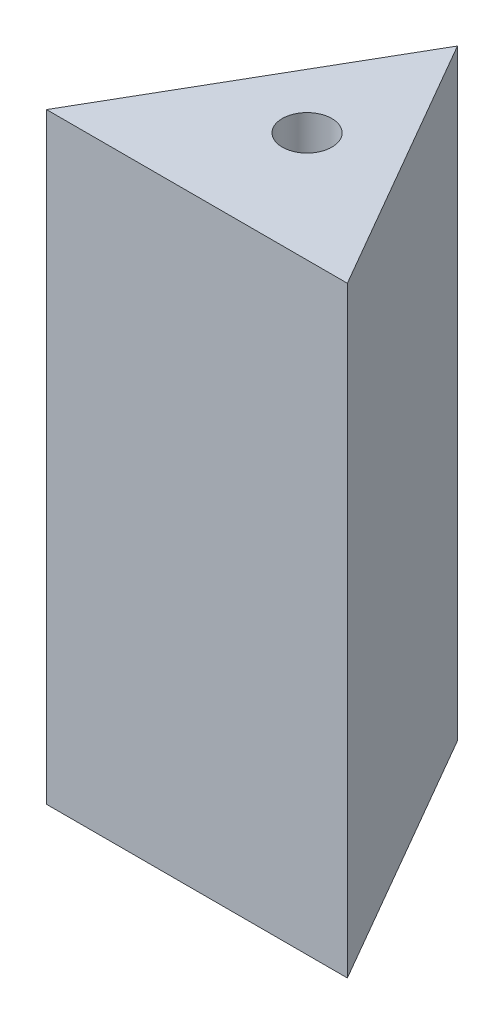
ISO-10303-21;
HEADER;
FILE_DESCRIPTION(('STEP AP214'),'2;1');
FILE_NAME('part.step','',(''),(''),'','','');
FILE_SCHEMA(('AUTOMOTIVE_DESIGN { 1 0 10303 214 1 1 1 1 }'));
ENDSEC;
DATA;
#1=APPLICATION_CONTEXT('core data for automotive mechanical design processes');
#2=APPLICATION_PROTOCOL_DEFINITION('international standard','automotive_design',2000,#1);
#3=PRODUCT_CONTEXT('',#1,'mechanical');
#4=PRODUCT('Part','Part','',(#3));
#5=PRODUCT_RELATED_PRODUCT_CATEGORY('part','',(#4));
#6=PRODUCT_DEFINITION_FORMATION('','',#4);
#7=PRODUCT_DEFINITION_CONTEXT('part definition',#1,'design');
#8=PRODUCT_DEFINITION('design','',#6,#7);
#9=PRODUCT_DEFINITION_SHAPE('','',#8);
#10=(LENGTH_UNIT() NAMED_UNIT(*) SI_UNIT(.MILLI.,.METRE.));
#11=(NAMED_UNIT(*) PLANE_ANGLE_UNIT() SI_UNIT($,.RADIAN.));
#12=(NAMED_UNIT(*) SI_UNIT($,.STERADIAN.) SOLID_ANGLE_UNIT());
#13=UNCERTAINTY_MEASURE_WITH_UNIT(LENGTH_MEASURE(1.E-05),#10,'distance_accuracy_value','');
#14=(GEOMETRIC_REPRESENTATION_CONTEXT(3) GLOBAL_UNCERTAINTY_ASSIGNED_CONTEXT((#13)) GLOBAL_UNIT_ASSIGNED_CONTEXT((#10,
#11,#12)) REPRESENTATION_CONTEXT('',''));
#15=CARTESIAN_POINT('',(0.,0.,0.));
#16=DIRECTION('',(0.,0.,1.));
#17=DIRECTION('',(1.,0.,0.));
#18=AXIS2_PLACEMENT_3D('',#15,#16,#17);
#19=CARTESIAN_POINT('',(0.,40.,0.));
#20=DIRECTION('',(-0.86602540378444,0.,-0.499999999999998));
#21=DIRECTION('',(-0.499999999999998,0.,0.86602540378444));
#22=AXIS2_PLACEMENT_3D('',#19,#20,#21);
#23=PLANE('',#22);
#24=DIRECTION('',(0.499999999999998,0.,-0.86602540378444));
#25=VECTOR('',#24,1.);
#26=CARTESIAN_POINT('',(0.,0.,0.));
#27=LINE('',#26,#25);
#28=CARTESIAN_POINT('',(0.,0.,0.));
#29=VERTEX_POINT('',#28);
#30=CARTESIAN_POINT('',(9.99999999999995,0.,-17.3205080756888));
#31=VERTEX_POINT('',#30);
#32=EDGE_CURVE('E111',#29,#31,#27,.T.);
#33=ORIENTED_EDGE('',*,*,#32,.F.);
#34=DIRECTION('',(0.,-1.,0.));
#35=VECTOR('',#34,1.);
#36=CARTESIAN_POINT('',(0.,40.,0.));
#37=LINE('',#36,#35);
#38=CARTESIAN_POINT('',(0.,40.,0.));
#39=VERTEX_POINT('',#38);
#40=EDGE_CURVE('E11',#39,#29,#37,.T.);
#41=ORIENTED_EDGE('',*,*,#40,.F.);
#42=DIRECTION('',(0.499999999999998,0.,-0.86602540378444));
#43=VECTOR('',#42,1.);
#44=CARTESIAN_POINT('',(0.,40.,0.));
#45=LINE('',#44,#43);
#46=CARTESIAN_POINT('',(9.99999999999995,40.,-17.3205080756888));
#47=VERTEX_POINT('',#46);
#48=EDGE_CURVE('E112',#39,#47,#45,.T.);
#49=ORIENTED_EDGE('',*,*,#48,.T.);
#50=DIRECTION('',(0.,-1.,0.));
#51=VECTOR('',#50,1.);
#52=CARTESIAN_POINT('',(9.99999999999995,40.,-17.3205080756888));
#53=LINE('',#52,#51);
#54=EDGE_CURVE('E62',#47,#31,#53,.T.);
#55=ORIENTED_EDGE('',*,*,#54,.T.);
#56=EDGE_LOOP('',(#33,#41,#49,#55));
#57=FACE_BOUND('',#56,.T.);
#58=ADVANCED_FACE('F45',(#57),#23,.T.);
#59=CARTESIAN_POINT('',(0.,40.,0.));
#60=DIRECTION('',(0.,0.,-1.));
#61=DIRECTION('',(-1.,0.,0.));
#62=AXIS2_PLACEMENT_3D('',#59,#60,#61);
#63=PLANE('',#62);
#64=DIRECTION('',(1.,0.,0.));
#65=VECTOR('',#64,1.);
#66=CARTESIAN_POINT('',(0.,0.,0.));
#67=LINE('',#66,#65);
#68=CARTESIAN_POINT('',(20.,0.,0.));
#69=VERTEX_POINT('',#68);
#70=EDGE_CURVE('E124',#29,#69,#67,.T.);
#71=ORIENTED_EDGE('',*,*,#70,.T.);
#72=DIRECTION('',(0.,-1.,0.));
#73=VECTOR('',#72,1.);
#74=CARTESIAN_POINT('',(20.,40.,0.));
#75=LINE('',#74,#73);
#76=CARTESIAN_POINT('',(20.,40.,0.));
#77=VERTEX_POINT('',#76);
#78=EDGE_CURVE('E54',#77,#69,#75,.T.);
#79=ORIENTED_EDGE('',*,*,#78,.F.);
#80=DIRECTION('',(1.,0.,0.));
#81=VECTOR('',#80,1.);
#82=CARTESIAN_POINT('',(0.,40.,0.));
#83=LINE('',#82,#81);
#84=EDGE_CURVE('E115',#39,#77,#83,.T.);
#85=ORIENTED_EDGE('',*,*,#84,.F.);
#86=ORIENTED_EDGE('',*,*,#40,.T.);
#87=EDGE_LOOP('',(#71,#79,#85,#86));
#88=FACE_BOUND('',#87,.T.);
#89=ADVANCED_FACE('F138',(#88),#63,.F.);
#90=CARTESIAN_POINT('',(15.,40.,-8.6602540378444));
#91=DIRECTION('',(0.866025403784438,0.,-0.500000000000001));
#92=DIRECTION('',(-0.500000000000001,0.,-0.866025403784438));
#93=AXIS2_PLACEMENT_3D('',#90,#91,#92);
#94=PLANE('',#93);
#95=DIRECTION('',(0.500000000000001,0.,0.866025403784438));
#96=VECTOR('',#95,1.);
#97=CARTESIAN_POINT('',(15.,0.,-8.6602540378444));
#98=LINE('',#97,#96);
#99=EDGE_CURVE('E116',#31,#69,#98,.T.);
#100=ORIENTED_EDGE('',*,*,#99,.F.);
#101=ORIENTED_EDGE('',*,*,#54,.F.);
#102=DIRECTION('',(0.500000000000001,0.,0.866025403784438));
#103=VECTOR('',#102,1.);
#104=CARTESIAN_POINT('',(15.,40.,-8.6602540378444));
#105=LINE('',#104,#103);
#106=EDGE_CURVE('E119',#47,#77,#105,.T.);
#107=ORIENTED_EDGE('',*,*,#106,.T.);
#108=ORIENTED_EDGE('',*,*,#78,.T.);
#109=EDGE_LOOP('',(#100,#101,#107,#108));
#110=FACE_BOUND('',#109,.T.);
#111=ADVANCED_FACE('F135',(#110),#94,.T.);
#112=CARTESIAN_POINT('',(0.,40.,0.));
#113=DIRECTION('',(0.,1.,0.));
#114=DIRECTION('',(0.,0.,1.));
#115=AXIS2_PLACEMENT_3D('',#112,#113,#114);
#116=PLANE('',#115);
#117=CARTESIAN_POINT('',(9.99999999999995,40.,-7.3205080756888));
#118=DIRECTION('',(0.,1.,0.));
#119=DIRECTION('',(0.,0.,1.));
#120=AXIS2_PLACEMENT_3D('',#117,#118,#119);
#121=CIRCLE('',#120,1.64999999999999);
#122=CARTESIAN_POINT('',(9.99999999999995,40.,-5.67050807568881));
#123=VERTEX_POINT('',#122);
#124=EDGE_CURVE('E98',#123,#123,#121,.T.);
#125=ORIENTED_EDGE('',*,*,#124,.F.);
#126=EDGE_LOOP('',(#125));
#127=FACE_BOUND('',#126,.T.);
#128=ORIENTED_EDGE('',*,*,#48,.F.);
#129=ORIENTED_EDGE('',*,*,#84,.T.);
#130=ORIENTED_EDGE('',*,*,#106,.F.);
#131=EDGE_LOOP('',(#128,#129,#130));
#132=FACE_BOUND('',#131,.T.);
#133=ADVANCED_FACE('F137',(#127,#132),#116,.T.);
#134=CARTESIAN_POINT('',(0.,0.,0.));
#135=DIRECTION('',(0.,1.,0.));
#136=DIRECTION('',(0.,0.,1.));
#137=AXIS2_PLACEMENT_3D('',#134,#135,#136);
#138=PLANE('',#137);
#139=CARTESIAN_POINT('',(9.99999999999995,0.,-7.3205080756888));
#140=DIRECTION('',(0.,-1.,0.));
#141=DIRECTION('',(0.,0.,-1.));
#142=AXIS2_PLACEMENT_3D('',#139,#140,#141);
#143=CIRCLE('',#142,1.64999999999999);
#144=CARTESIAN_POINT('',(9.99999999999995,0.,-8.97050807568879));
#145=VERTEX_POINT('',#144);
#146=EDGE_CURVE('E97',#145,#145,#143,.T.);
#147=ORIENTED_EDGE('',*,*,#146,.F.);
#148=EDGE_LOOP('',(#147));
#149=FACE_BOUND('',#148,.T.);
#150=ORIENTED_EDGE('',*,*,#32,.T.);
#151=ORIENTED_EDGE('',*,*,#99,.T.);
#152=ORIENTED_EDGE('',*,*,#70,.F.);
#153=EDGE_LOOP('',(#150,#151,#152));
#154=FACE_BOUND('',#153,.T.);
#155=ADVANCED_FACE('F134',(#149,#154),#138,.F.);
#156=CARTESIAN_POINT('',(9.99999999999995,10.1,-7.3205080756888));
#157=DIRECTION('',(0.,-1.,0.));
#158=DIRECTION('',(0.,0.,-1.));
#159=AXIS2_PLACEMENT_3D('',#156,#157,#158);
#160=CONICAL_SURFACE('',#159,1.64999999999999,1.02974425867665);
#161=CARTESIAN_POINT('',(9.99999999999995,11.0914200213955,-7.3205080756888));
#162=VERTEX_POINT('',#161);
#163=VERTEX_LOOP('',#162);
#164=FACE_BOUND('',#163,.T.);
#165=CARTESIAN_POINT('',(9.99999999999995,10.1,-7.3205080756888));
#166=DIRECTION('',(0.,-1.,0.));
#167=DIRECTION('',(0.,0.,-1.));
#168=AXIS2_PLACEMENT_3D('',#165,#166,#167);
#169=CIRCLE('',#168,1.64999999999999);
#170=CARTESIAN_POINT('',(9.99999999999995,10.1,-8.97050807568879));
#171=VERTEX_POINT('',#170);
#172=EDGE_CURVE('E103',#171,#171,#169,.T.);
#173=ORIENTED_EDGE('',*,*,#172,.T.);
#174=EDGE_LOOP('',(#173));
#175=FACE_BOUND('',#174,.T.);
#176=ADVANCED_FACE('F169',(#164,#175),#160,.F.);
#177=CARTESIAN_POINT('',(9.99999999999995,0.,-7.3205080756888));
#178=DIRECTION('',(0.,-1.,0.));
#179=DIRECTION('',(0.,0.,-1.));
#180=AXIS2_PLACEMENT_3D('',#177,#178,#179);
#181=CYLINDRICAL_SURFACE('',#180,1.64999999999999);
#182=ORIENTED_EDGE('',*,*,#172,.F.);
#183=EDGE_LOOP('',(#182));
#184=FACE_BOUND('',#183,.T.);
#185=ORIENTED_EDGE('',*,*,#146,.T.);
#186=EDGE_LOOP('',(#185));
#187=FACE_BOUND('',#186,.T.);
#188=ADVANCED_FACE('F90',(#184,#187),#181,.F.);
#189=CARTESIAN_POINT('',(9.99999999999995,29.9,-7.3205080756888));
#190=DIRECTION('',(0.,1.,0.));
#191=DIRECTION('',(0.,0.,1.));
#192=AXIS2_PLACEMENT_3D('',#189,#190,#191);
#193=CONICAL_SURFACE('',#192,1.64999999999999,1.02974425867665);
#194=CARTESIAN_POINT('',(9.99999999999995,28.9085799786045,-7.3205080756888));
#195=VERTEX_POINT('',#194);
#196=VERTEX_LOOP('',#195);
#197=FACE_BOUND('',#196,.T.);
#198=CARTESIAN_POINT('',(9.99999999999995,29.9,-7.3205080756888));
#199=DIRECTION('',(0.,1.,0.));
#200=DIRECTION('',(0.,0.,1.));
#201=AXIS2_PLACEMENT_3D('',#198,#199,#200);
#202=CIRCLE('',#201,1.64999999999999);
#203=CARTESIAN_POINT('',(9.99999999999995,29.9,-5.67050807568881));
#204=VERTEX_POINT('',#203);
#205=EDGE_CURVE('E94',#204,#204,#202,.T.);
#206=ORIENTED_EDGE('',*,*,#205,.T.);
#207=EDGE_LOOP('',(#206));
#208=FACE_BOUND('',#207,.T.);
#209=ADVANCED_FACE('F86',(#197,#208),#193,.F.);
#210=CARTESIAN_POINT('',(9.99999999999995,40.,-7.3205080756888));
#211=DIRECTION('',(0.,1.,0.));
#212=DIRECTION('',(0.,0.,1.));
#213=AXIS2_PLACEMENT_3D('',#210,#211,#212);
#214=CYLINDRICAL_SURFACE('',#213,1.64999999999999);
#215=ORIENTED_EDGE('',*,*,#205,.F.);
#216=EDGE_LOOP('',(#215));
#217=FACE_BOUND('',#216,.T.);
#218=ORIENTED_EDGE('',*,*,#124,.T.);
#219=EDGE_LOOP('',(#218));
#220=FACE_BOUND('',#219,.T.);
#221=ADVANCED_FACE('F89',(#217,#220),#214,.F.);
#222=CLOSED_SHELL('',(#58,#89,#111,#133,#155,#176,#188,#209,#221));
#223=MANIFOLD_SOLID_BREP('B2',#222);
#224=ADVANCED_BREP_SHAPE_REPRESENTATION('',(#18,#223),#14);
#225=SHAPE_DEFINITION_REPRESENTATION(#9,#224);
ENDSEC;
END-ISO-10303-21;
